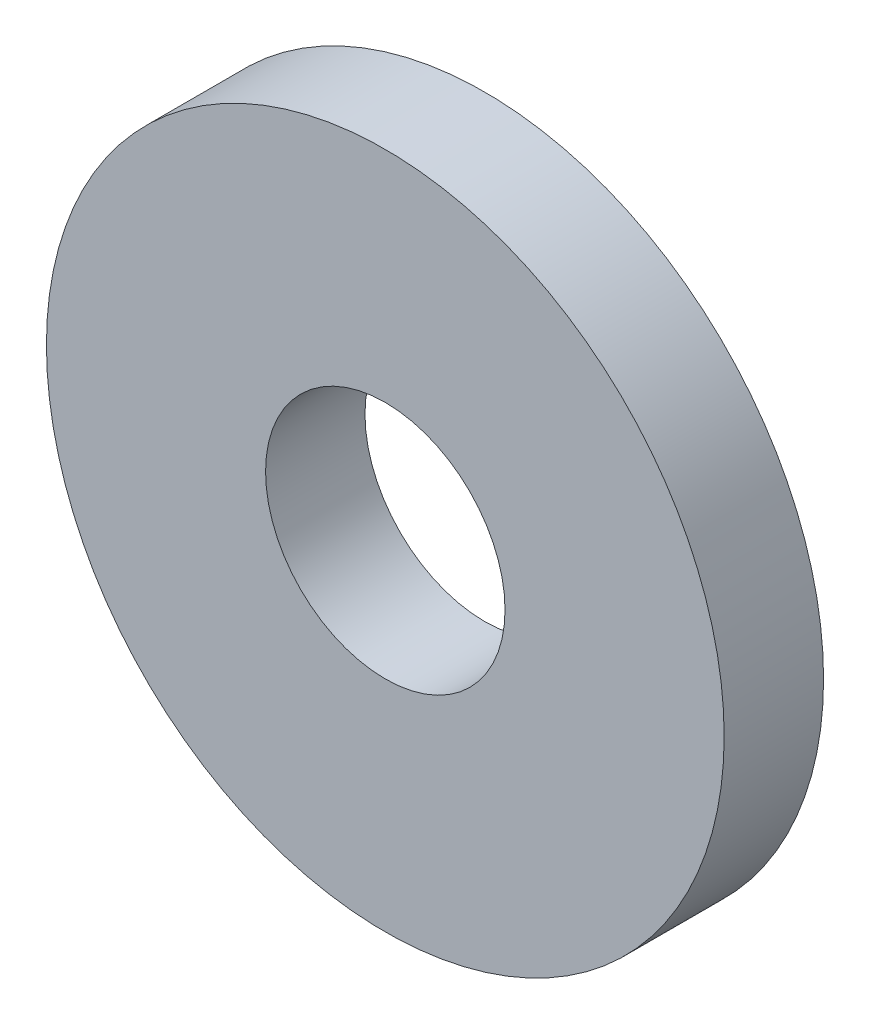
ISO-10303-21;
HEADER;
FILE_DESCRIPTION(('STEP AP214'),'2;1');
FILE_NAME('part.step','',(''),(''),'','','');
FILE_SCHEMA(('AUTOMOTIVE_DESIGN { 1 0 10303 214 1 1 1 1 }'));
ENDSEC;
DATA;
#1=APPLICATION_CONTEXT('core data for automotive mechanical design processes');
#2=APPLICATION_PROTOCOL_DEFINITION('international standard','automotive_design',2000,#1);
#3=PRODUCT_CONTEXT('',#1,'mechanical');
#4=PRODUCT('Part','Part','',(#3));
#5=PRODUCT_RELATED_PRODUCT_CATEGORY('part','',(#4));
#6=PRODUCT_DEFINITION_FORMATION('','',#4);
#7=PRODUCT_DEFINITION_CONTEXT('part definition',#1,'design');
#8=PRODUCT_DEFINITION('design','',#6,#7);
#9=PRODUCT_DEFINITION_SHAPE('','',#8);
#10=(LENGTH_UNIT() NAMED_UNIT(*) SI_UNIT(.MILLI.,.METRE.));
#11=(NAMED_UNIT(*) PLANE_ANGLE_UNIT() SI_UNIT($,.RADIAN.));
#12=(NAMED_UNIT(*) SI_UNIT($,.STERADIAN.) SOLID_ANGLE_UNIT());
#13=UNCERTAINTY_MEASURE_WITH_UNIT(LENGTH_MEASURE(1.E-05),#10,'distance_accuracy_value','');
#14=(GEOMETRIC_REPRESENTATION_CONTEXT(3) GLOBAL_UNCERTAINTY_ASSIGNED_CONTEXT((#13)) GLOBAL_UNIT_ASSIGNED_CONTEXT((#10,
#11,#12)) REPRESENTATION_CONTEXT('',''));
#15=CARTESIAN_POINT('',(0.,0.,0.));
#16=DIRECTION('',(0.,0.,1.));
#17=DIRECTION('',(1.,0.,0.));
#18=AXIS2_PLACEMENT_3D('',#15,#16,#17);
#19=CARTESIAN_POINT('',(0.,0.,-1.1));
#20=DIRECTION('',(0.,0.,1.));
#21=DIRECTION('',(1.,0.,0.));
#22=AXIS2_PLACEMENT_3D('',#19,#20,#21);
#23=CYLINDRICAL_SURFACE('',#22,7.5);
#24=CARTESIAN_POINT('',(0.,0.,-1.1));
#25=DIRECTION('',(0.,0.,1.));
#26=DIRECTION('',(1.,0.,0.));
#27=AXIS2_PLACEMENT_3D('',#24,#25,#26);
#28=CIRCLE('',#27,7.5);
#29=CARTESIAN_POINT('',(7.5,0.,-1.1));
#30=VERTEX_POINT('',#29);
#31=EDGE_CURVE('E10',#30,#30,#28,.T.);
#32=ORIENTED_EDGE('',*,*,#31,.T.);
#33=EDGE_LOOP('',(#32));
#34=FACE_BOUND('',#33,.T.);
#35=CARTESIAN_POINT('',(0.,0.,1.1));
#36=DIRECTION('',(0.,0.,1.));
#37=DIRECTION('',(1.,0.,0.));
#38=AXIS2_PLACEMENT_3D('',#35,#36,#37);
#39=CIRCLE('',#38,7.5);
#40=CARTESIAN_POINT('',(7.5,0.,1.1));
#41=VERTEX_POINT('',#40);
#42=EDGE_CURVE('E45',#41,#41,#39,.T.);
#43=ORIENTED_EDGE('',*,*,#42,.F.);
#44=EDGE_LOOP('',(#43));
#45=FACE_BOUND('',#44,.T.);
#46=ADVANCED_FACE('F35',(#34,#45),#23,.T.);
#47=CARTESIAN_POINT('',(0.,0.,-1.1));
#48=DIRECTION('',(0.,0.,1.));
#49=DIRECTION('',(1.,0.,0.));
#50=AXIS2_PLACEMENT_3D('',#47,#48,#49);
#51=PLANE('',#50);
#52=CARTESIAN_POINT('',(0.,0.,-1.1));
#53=DIRECTION('',(0.,0.,1.));
#54=DIRECTION('',(1.,0.,0.));
#55=AXIS2_PLACEMENT_3D('',#52,#53,#54);
#56=CIRCLE('',#55,2.65);
#57=CARTESIAN_POINT('',(2.65,0.,-1.1));
#58=VERTEX_POINT('',#57);
#59=EDGE_CURVE('E41',#58,#58,#56,.T.);
#60=ORIENTED_EDGE('',*,*,#59,.T.);
#61=EDGE_LOOP('',(#60));
#62=FACE_BOUND('',#61,.T.);
#63=ORIENTED_EDGE('',*,*,#31,.F.);
#64=EDGE_LOOP('',(#63));
#65=FACE_BOUND('',#64,.T.);
#66=ADVANCED_FACE('F64',(#62,#65),#51,.F.);
#67=CARTESIAN_POINT('',(0.,0.,-1.1));
#68=DIRECTION('',(0.,0.,1.));
#69=DIRECTION('',(1.,0.,0.));
#70=AXIS2_PLACEMENT_3D('',#67,#68,#69);
#71=CYLINDRICAL_SURFACE('',#70,2.65);
#72=ORIENTED_EDGE('',*,*,#59,.F.);
#73=EDGE_LOOP('',(#72));
#74=FACE_BOUND('',#73,.T.);
#75=CARTESIAN_POINT('',(0.,0.,1.1));
#76=DIRECTION('',(0.,0.,1.));
#77=DIRECTION('',(1.,0.,0.));
#78=AXIS2_PLACEMENT_3D('',#75,#76,#77);
#79=CIRCLE('',#78,2.65);
#80=CARTESIAN_POINT('',(2.65,0.,1.1));
#81=VERTEX_POINT('',#80);
#82=EDGE_CURVE('E49',#81,#81,#79,.T.);
#83=ORIENTED_EDGE('',*,*,#82,.T.);
#84=EDGE_LOOP('',(#83));
#85=FACE_BOUND('',#84,.T.);
#86=ADVANCED_FACE('F55',(#74,#85),#71,.F.);
#87=CARTESIAN_POINT('',(0.,0.,1.1));
#88=DIRECTION('',(0.,0.,1.));
#89=DIRECTION('',(1.,0.,0.));
#90=AXIS2_PLACEMENT_3D('',#87,#88,#89);
#91=PLANE('',#90);
#92=ORIENTED_EDGE('',*,*,#42,.T.);
#93=EDGE_LOOP('',(#92));
#94=FACE_BOUND('',#93,.T.);
#95=ORIENTED_EDGE('',*,*,#82,.F.);
#96=EDGE_LOOP('',(#95));
#97=FACE_BOUND('',#96,.T.);
#98=ADVANCED_FACE('F57',(#94,#97),#91,.T.);
#99=CLOSED_SHELL('',(#46,#66,#86,#98));
#100=MANIFOLD_SOLID_BREP('B2',#99);
#101=ADVANCED_BREP_SHAPE_REPRESENTATION('',(#18,#100),#14);
#102=SHAPE_DEFINITION_REPRESENTATION(#9,#101);
ENDSEC;
END-ISO-10303-21;
